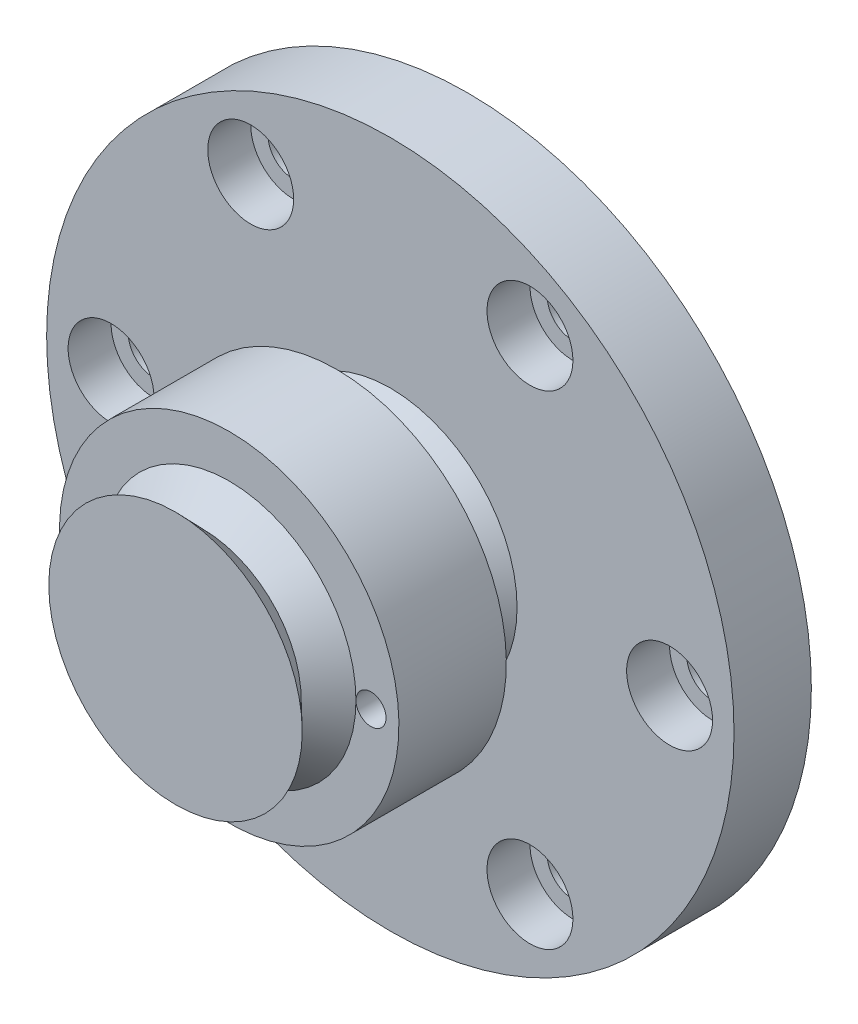
ISO-10303-21;
HEADER;
FILE_DESCRIPTION(('STEP AP214'),'2;1');
FILE_NAME('part.step','',(''),(''),'','','');
FILE_SCHEMA(('AUTOMOTIVE_DESIGN { 1 0 10303 214 1 1 1 1 }'));
ENDSEC;
DATA;
#1=APPLICATION_CONTEXT('core data for automotive mechanical design processes');
#2=APPLICATION_PROTOCOL_DEFINITION('international standard','automotive_design',2000,#1);
#3=PRODUCT_CONTEXT('',#1,'mechanical');
#4=PRODUCT('Part','Part','',(#3));
#5=PRODUCT_RELATED_PRODUCT_CATEGORY('part','',(#4));
#6=PRODUCT_DEFINITION_FORMATION('','',#4);
#7=PRODUCT_DEFINITION_CONTEXT('part definition',#1,'design');
#8=PRODUCT_DEFINITION('design','',#6,#7);
#9=PRODUCT_DEFINITION_SHAPE('','',#8);
#10=(LENGTH_UNIT() NAMED_UNIT(*) SI_UNIT(.MILLI.,.METRE.));
#11=(NAMED_UNIT(*) PLANE_ANGLE_UNIT() SI_UNIT($,.RADIAN.));
#12=(NAMED_UNIT(*) SI_UNIT($,.STERADIAN.) SOLID_ANGLE_UNIT());
#13=UNCERTAINTY_MEASURE_WITH_UNIT(LENGTH_MEASURE(1.E-05),#10,'distance_accuracy_value','');
#14=(GEOMETRIC_REPRESENTATION_CONTEXT(3) GLOBAL_UNCERTAINTY_ASSIGNED_CONTEXT((#13)) GLOBAL_UNIT_ASSIGNED_CONTEXT((#10,
#11,#12)) REPRESENTATION_CONTEXT('',''));
#15=CARTESIAN_POINT('',(0.,0.,0.));
#16=DIRECTION('',(0.,0.,1.));
#17=DIRECTION('',(1.,0.,0.));
#18=AXIS2_PLACEMENT_3D('',#15,#16,#17);
#19=CARTESIAN_POINT('',(0.,0.,13.6));
#20=DIRECTION('',(0.,0.,-1.));
#21=DIRECTION('',(-1.,0.,0.));
#22=AXIS2_PLACEMENT_3D('',#19,#20,#21);
#23=CYLINDRICAL_SURFACE('',#22,7.9);
#24=CARTESIAN_POINT('',(0.,0.,6.1));
#25=DIRECTION('',(0.,0.,-1.));
#26=DIRECTION('',(0.,1.,0.));
#27=AXIS2_PLACEMENT_3D('',#24,#25,#26);
#28=CIRCLE('',#27,7.9);
#29=CARTESIAN_POINT('',(0.,7.9,6.1));
#30=VERTEX_POINT('',#29);
#31=EDGE_CURVE('E68',#30,#30,#28,.T.);
#32=ORIENTED_EDGE('',*,*,#31,.F.);
#33=EDGE_LOOP('',(#32));
#34=FACE_BOUND('',#33,.T.);
#35=CARTESIAN_POINT('',(0.,0.,11.1));
#36=DIRECTION('',(0.,0.,-1.));
#37=DIRECTION('',(0.,1.,0.));
#38=AXIS2_PLACEMENT_3D('',#35,#36,#37);
#39=CIRCLE('',#38,7.9);
#40=CARTESIAN_POINT('',(0.,7.9,11.1));
#41=VERTEX_POINT('',#40);
#42=EDGE_CURVE('E71',#41,#41,#39,.T.);
#43=ORIENTED_EDGE('',*,*,#42,.T.);
#44=EDGE_LOOP('',(#43));
#45=FACE_BOUND('',#44,.T.);
#46=ADVANCED_FACE('F33',(#34,#45),#23,.T.);
#47=CARTESIAN_POINT('',(0.,0.,13.6));
#48=DIRECTION('',(0.,0.,1.));
#49=DIRECTION('',(0.,-1.,0.));
#50=AXIS2_PLACEMENT_3D('',#47,#48,#49);
#51=CONICAL_SURFACE('',#50,5.9,0.805003494254653);
#52=CARTESIAN_POINT('',(0.,0.,12.35));
#53=DIRECTION('',(0.,0.,-1.));
#54=DIRECTION('',(0.,1.,0.));
#55=AXIS2_PLACEMENT_3D('',#52,#53,#54);
#56=CIRCLE('',#55,4.6);
#57=CARTESIAN_POINT('',(0.,4.6,12.35));
#58=VERTEX_POINT('',#57);
#59=EDGE_CURVE('E77',#58,#58,#56,.T.);
#60=ORIENTED_EDGE('',*,*,#59,.F.);
#61=EDGE_LOOP('',(#60));
#62=FACE_BOUND('',#61,.T.);
#63=CARTESIAN_POINT('',(0.,0.,13.6));
#64=DIRECTION('',(0.,0.,-1.));
#65=DIRECTION('',(0.,1.,0.));
#66=AXIS2_PLACEMENT_3D('',#63,#64,#65);
#67=CIRCLE('',#66,5.9);
#68=CARTESIAN_POINT('',(0.,5.9,13.6));
#69=VERTEX_POINT('',#68);
#70=EDGE_CURVE('E80',#69,#69,#67,.T.);
#71=ORIENTED_EDGE('',*,*,#70,.T.);
#72=EDGE_LOOP('',(#71));
#73=FACE_BOUND('',#72,.T.);
#74=ADVANCED_FACE('F223',(#62,#73),#51,.T.);
#75=CARTESIAN_POINT('',(0.,0.,12.35));
#76=DIRECTION('',(0.,0.,-1.));
#77=DIRECTION('',(0.,1.,0.));
#78=AXIS2_PLACEMENT_3D('',#75,#76,#77);
#79=CONICAL_SURFACE('',#78,4.6,0.805003494254653);
#80=CARTESIAN_POINT('',(0.,0.,11.1));
#81=DIRECTION('',(0.,0.,-1.));
#82=DIRECTION('',(0.,1.,0.));
#83=AXIS2_PLACEMENT_3D('',#80,#81,#82);
#84=CIRCLE('',#83,5.9);
#85=CARTESIAN_POINT('',(5.9,0.,11.1));
#86=VERTEX_POINT('',#85);
#87=EDGE_CURVE('E74',#86,#86,#84,.T.);
#88=ORIENTED_EDGE('',*,*,#87,.F.);
#89=EDGE_LOOP('',(#88));
#90=FACE_BOUND('',#89,.T.);
#91=ORIENTED_EDGE('',*,*,#59,.T.);
#92=EDGE_LOOP('',(#91));
#93=FACE_BOUND('',#92,.T.);
#94=ADVANCED_FACE('F230',(#90,#93),#79,.T.);
#95=CARTESIAN_POINT('',(0.,5.9,11.1));
#96=DIRECTION('',(0.,0.,-1.));
#97=DIRECTION('',(0.,1.,0.));
#98=AXIS2_PLACEMENT_3D('',#95,#96,#97);
#99=PLANE('',#98);
#100=ORIENTED_EDGE('',*,*,#42,.F.);
#101=EDGE_LOOP('',(#100));
#102=FACE_BOUND('',#101,.T.);
#103=ORIENTED_EDGE('',*,*,#87,.T.);
#104=CARTESIAN_POINT('',(6.6,0.,11.1));
#105=DIRECTION('',(0.,0.,1.));
#106=DIRECTION('',(1.,0.,0.));
#107=AXIS2_PLACEMENT_3D('',#104,#105,#106);
#108=CIRCLE('',#107,0.7);
#109=EDGE_CURVE('E48',#86,#86,#108,.T.);
#110=ORIENTED_EDGE('',*,*,#109,.F.);
#111=EDGE_LOOP('',(#103,#110));
#112=FACE_BOUND('',#111,.T.);
#113=ADVANCED_FACE('F227',(#102,#112),#99,.F.);
#114=CARTESIAN_POINT('',(0.,0.,13.6));
#115=DIRECTION('',(0.,0.,1.));
#116=DIRECTION('',(1.,0.,0.));
#117=AXIS2_PLACEMENT_3D('',#114,#115,#116);
#118=PLANE('',#117);
#119=ORIENTED_EDGE('',*,*,#70,.F.);
#120=EDGE_LOOP('',(#119));
#121=FACE_BOUND('',#120,.T.);
#122=ADVANCED_FACE('F217',(#121),#118,.T.);
#123=CARTESIAN_POINT('',(0.,5.9,6.1));
#124=DIRECTION('',(0.,0.,1.));
#125=DIRECTION('',(0.,-1.,0.));
#126=AXIS2_PLACEMENT_3D('',#123,#124,#125);
#127=PLANE('',#126);
#128=CARTESIAN_POINT('',(0.,0.,6.1));
#129=DIRECTION('',(0.,0.,-1.));
#130=DIRECTION('',(0.,1.,0.));
#131=AXIS2_PLACEMENT_3D('',#128,#129,#130);
#132=CIRCLE('',#131,5.9);
#133=CARTESIAN_POINT('',(5.9,0.,6.1));
#134=VERTEX_POINT('',#133);
#135=EDGE_CURVE('E57',#134,#134,#132,.T.);
#136=ORIENTED_EDGE('',*,*,#135,.F.);
#137=CARTESIAN_POINT('',(6.6,0.,6.1));
#138=DIRECTION('',(0.,0.,1.));
#139=DIRECTION('',(0.,-1.,0.));
#140=AXIS2_PLACEMENT_3D('',#137,#138,#139);
#141=CIRCLE('',#140,0.7);
#142=EDGE_CURVE('E52',#134,#134,#141,.F.);
#143=ORIENTED_EDGE('',*,*,#142,.F.);
#144=EDGE_LOOP('',(#136,#143));
#145=FACE_BOUND('',#144,.T.);
#146=ORIENTED_EDGE('',*,*,#31,.T.);
#147=EDGE_LOOP('',(#146));
#148=FACE_BOUND('',#147,.T.);
#149=ADVANCED_FACE('F207',(#145,#148),#127,.F.);
#150=CARTESIAN_POINT('',(0.,0.,4.85));
#151=DIRECTION('',(0.,0.,-1.));
#152=DIRECTION('',(0.,1.,0.));
#153=AXIS2_PLACEMENT_3D('',#150,#151,#152);
#154=CONICAL_SURFACE('',#153,4.6,0.805003494254653);
#155=CARTESIAN_POINT('',(0.,0.,3.6));
#156=DIRECTION('',(0.,0.,-1.));
#157=DIRECTION('',(0.,1.,0.));
#158=AXIS2_PLACEMENT_3D('',#155,#156,#157);
#159=CIRCLE('',#158,5.9);
#160=CARTESIAN_POINT('',(0.,5.9,3.6));
#161=VERTEX_POINT('',#160);
#162=EDGE_CURVE('E65',#161,#161,#159,.T.);
#163=ORIENTED_EDGE('',*,*,#162,.F.);
#164=EDGE_LOOP('',(#163));
#165=FACE_BOUND('',#164,.T.);
#166=CARTESIAN_POINT('',(0.,0.,4.85));
#167=DIRECTION('',(0.,0.,-1.));
#168=DIRECTION('',(0.,1.,0.));
#169=AXIS2_PLACEMENT_3D('',#166,#167,#168);
#170=CIRCLE('',#169,4.6);
#171=CARTESIAN_POINT('',(0.,4.6,4.85));
#172=VERTEX_POINT('',#171);
#173=EDGE_CURVE('E59',#172,#172,#170,.T.);
#174=ORIENTED_EDGE('',*,*,#173,.T.);
#175=EDGE_LOOP('',(#174));
#176=FACE_BOUND('',#175,.T.);
#177=ADVANCED_FACE('F203',(#165,#176),#154,.T.);
#178=CARTESIAN_POINT('',(0.,0.,6.1));
#179=DIRECTION('',(0.,0.,1.));
#180=DIRECTION('',(0.,-1.,0.));
#181=AXIS2_PLACEMENT_3D('',#178,#179,#180);
#182=CONICAL_SURFACE('',#181,5.9,0.805003494254653);
#183=ORIENTED_EDGE('',*,*,#173,.F.);
#184=EDGE_LOOP('',(#183));
#185=FACE_BOUND('',#184,.T.);
#186=ORIENTED_EDGE('',*,*,#135,.T.);
#187=EDGE_LOOP('',(#186));
#188=FACE_BOUND('',#187,.T.);
#189=ADVANCED_FACE('F206',(#185,#188),#182,.T.);
#190=CARTESIAN_POINT('',(6.,0.,2.));
#191=DIRECTION('',(0.,0.,-1.));
#192=DIRECTION('',(-1.,0.,0.));
#193=AXIS2_PLACEMENT_3D('',#190,#191,#192);
#194=PLANE('',#193);
#195=CARTESIAN_POINT('',(6.,0.,2.));
#196=DIRECTION('',(0.,0.,-1.));
#197=DIRECTION('',(-1.,0.,0.));
#198=AXIS2_PLACEMENT_3D('',#195,#196,#197);
#199=CIRCLE('',#198,1.);
#200=CARTESIAN_POINT('',(5.,0.,2.));
#201=VERTEX_POINT('',#200);
#202=EDGE_CURVE('E90',#201,#201,#199,.T.);
#203=ORIENTED_EDGE('',*,*,#202,.T.);
#204=EDGE_LOOP('',(#203));
#205=FACE_BOUND('',#204,.T.);
#206=ADVANCED_FACE('F213',(#205),#194,.T.);
#207=CARTESIAN_POINT('',(-6.,0.,2.));
#208=DIRECTION('',(0.,0.,-1.));
#209=DIRECTION('',(-1.,0.,0.));
#210=AXIS2_PLACEMENT_3D('',#207,#208,#209);
#211=PLANE('',#210);
#212=CARTESIAN_POINT('',(-6.,0.,2.));
#213=DIRECTION('',(0.,0.,-1.));
#214=DIRECTION('',(-1.,0.,0.));
#215=AXIS2_PLACEMENT_3D('',#212,#213,#214);
#216=CIRCLE('',#215,1.);
#217=CARTESIAN_POINT('',(-7.,0.,2.));
#218=VERTEX_POINT('',#217);
#219=EDGE_CURVE('E84',#218,#218,#216,.T.);
#220=ORIENTED_EDGE('',*,*,#219,.T.);
#221=EDGE_LOOP('',(#220));
#222=FACE_BOUND('',#221,.T.);
#223=ADVANCED_FACE('F249',(#222),#211,.T.);
#224=CARTESIAN_POINT('',(6.,0.,2.));
#225=DIRECTION('',(0.,0.,-1.));
#226=DIRECTION('',(-1.,0.,0.));
#227=AXIS2_PLACEMENT_3D('',#224,#225,#226);
#228=CYLINDRICAL_SURFACE('',#227,1.);
#229=ORIENTED_EDGE('',*,*,#202,.F.);
#230=EDGE_LOOP('',(#229));
#231=FACE_BOUND('',#230,.T.);
#232=CARTESIAN_POINT('',(6.,0.,0.));
#233=DIRECTION('',(0.,0.,-1.));
#234=DIRECTION('',(-1.,0.,0.));
#235=AXIS2_PLACEMENT_3D('',#232,#233,#234);
#236=CIRCLE('',#235,1.);
#237=CARTESIAN_POINT('',(5.,0.,0.));
#238=VERTEX_POINT('',#237);
#239=EDGE_CURVE('E87',#238,#238,#236,.T.);
#240=ORIENTED_EDGE('',*,*,#239,.T.);
#241=EDGE_LOOP('',(#240));
#242=FACE_BOUND('',#241,.T.);
#243=ADVANCED_FACE('F252',(#231,#242),#228,.F.);
#244=CARTESIAN_POINT('',(-6.,0.,2.));
#245=DIRECTION('',(0.,0.,-1.));
#246=DIRECTION('',(-1.,0.,0.));
#247=AXIS2_PLACEMENT_3D('',#244,#245,#246);
#248=CYLINDRICAL_SURFACE('',#247,1.);
#249=ORIENTED_EDGE('',*,*,#219,.F.);
#250=EDGE_LOOP('',(#249));
#251=FACE_BOUND('',#250,.T.);
#252=CARTESIAN_POINT('',(-6.,0.,0.));
#253=DIRECTION('',(0.,0.,-1.));
#254=DIRECTION('',(-1.,0.,0.));
#255=AXIS2_PLACEMENT_3D('',#252,#253,#254);
#256=CIRCLE('',#255,1.);
#257=CARTESIAN_POINT('',(-7.,0.,0.));
#258=VERTEX_POINT('',#257);
#259=EDGE_CURVE('E83',#258,#258,#256,.T.);
#260=ORIENTED_EDGE('',*,*,#259,.T.);
#261=EDGE_LOOP('',(#260));
#262=FACE_BOUND('',#261,.T.);
#263=ADVANCED_FACE('F254',(#251,#262),#248,.F.);
#264=CARTESIAN_POINT('',(13.,0.,3.6));
#265=DIRECTION('',(0.,0.,-1.));
#266=DIRECTION('',(-1.,0.,0.));
#267=AXIS2_PLACEMENT_3D('',#264,#265,#266);
#268=CYLINDRICAL_SURFACE('',#267,1.2);
#269=CARTESIAN_POINT('',(13.,0.,0.));
#270=DIRECTION('',(0.,0.,1.));
#271=DIRECTION('',(1.,0.,0.));
#272=AXIS2_PLACEMENT_3D('',#269,#270,#271);
#273=CIRCLE('',#272,1.2);
#274=CARTESIAN_POINT('',(14.2,0.,0.));
#275=VERTEX_POINT('',#274);
#276=EDGE_CURVE('E148',#275,#275,#273,.T.);
#277=ORIENTED_EDGE('',*,*,#276,.F.);
#278=EDGE_LOOP('',(#277));
#279=FACE_BOUND('',#278,.T.);
#280=CARTESIAN_POINT('',(13.,0.,1.6));
#281=DIRECTION('',(0.,0.,1.));
#282=DIRECTION('',(1.,0.,0.));
#283=AXIS2_PLACEMENT_3D('',#280,#281,#282);
#284=CIRCLE('',#283,1.2);
#285=CARTESIAN_POINT('',(14.2,0.,1.6));
#286=VERTEX_POINT('',#285);
#287=EDGE_CURVE('E129',#286,#286,#284,.T.);
#288=ORIENTED_EDGE('',*,*,#287,.T.);
#289=EDGE_LOOP('',(#288));
#290=FACE_BOUND('',#289,.T.);
#291=ADVANCED_FACE('F257',(#279,#290),#268,.F.);
#292=CARTESIAN_POINT('',(6.50000000000013,11.2583302491976,3.6));
#293=DIRECTION('',(0.,0.,-1.));
#294=DIRECTION('',(-1.,0.,0.));
#295=AXIS2_PLACEMENT_3D('',#292,#293,#294);
#296=CYLINDRICAL_SURFACE('',#295,1.2);
#297=CARTESIAN_POINT('',(6.50000000000013,11.2583302491976,0.));
#298=DIRECTION('',(0.,0.,1.));
#299=DIRECTION('',(1.,0.,0.));
#300=AXIS2_PLACEMENT_3D('',#297,#298,#299);
#301=CIRCLE('',#300,1.2);
#302=CARTESIAN_POINT('',(7.70000000000013,11.2583302491976,0.));
#303=VERTEX_POINT('',#302);
#304=EDGE_CURVE('E133',#303,#303,#301,.T.);
#305=ORIENTED_EDGE('',*,*,#304,.F.);
#306=EDGE_LOOP('',(#305));
#307=FACE_BOUND('',#306,.T.);
#308=CARTESIAN_POINT('',(6.50000000000013,11.2583302491976,1.6));
#309=DIRECTION('',(0.,0.,1.));
#310=DIRECTION('',(1.,0.,0.));
#311=AXIS2_PLACEMENT_3D('',#308,#309,#310);
#312=CIRCLE('',#311,1.2);
#313=CARTESIAN_POINT('',(7.70000000000013,11.2583302491976,1.6));
#314=VERTEX_POINT('',#313);
#315=EDGE_CURVE('E99',#314,#314,#312,.T.);
#316=ORIENTED_EDGE('',*,*,#315,.T.);
#317=EDGE_LOOP('',(#316));
#318=FACE_BOUND('',#317,.T.);
#319=ADVANCED_FACE('F304',(#307,#318),#296,.F.);
#320=CARTESIAN_POINT('',(-6.4999999999999,11.2583302491978,3.6));
#321=DIRECTION('',(0.,0.,-1.));
#322=DIRECTION('',(-1.,0.,0.));
#323=AXIS2_PLACEMENT_3D('',#320,#321,#322);
#324=CYLINDRICAL_SURFACE('',#323,1.2);
#325=CARTESIAN_POINT('',(-6.4999999999999,11.2583302491978,0.));
#326=DIRECTION('',(0.,0.,1.));
#327=DIRECTION('',(1.,0.,0.));
#328=AXIS2_PLACEMENT_3D('',#325,#326,#327);
#329=CIRCLE('',#328,1.2);
#330=CARTESIAN_POINT('',(-5.29999999999989,11.2583302491978,0.));
#331=VERTEX_POINT('',#330);
#332=EDGE_CURVE('E136',#331,#331,#329,.T.);
#333=ORIENTED_EDGE('',*,*,#332,.F.);
#334=EDGE_LOOP('',(#333));
#335=FACE_BOUND('',#334,.T.);
#336=CARTESIAN_POINT('',(-6.4999999999999,11.2583302491978,1.6));
#337=DIRECTION('',(0.,0.,1.));
#338=DIRECTION('',(1.,0.,0.));
#339=AXIS2_PLACEMENT_3D('',#336,#337,#338);
#340=CIRCLE('',#339,1.2);
#341=CARTESIAN_POINT('',(-5.29999999999989,11.2583302491978,1.6));
#342=VERTEX_POINT('',#341);
#343=EDGE_CURVE('E157',#342,#342,#340,.T.);
#344=ORIENTED_EDGE('',*,*,#343,.T.);
#345=EDGE_LOOP('',(#344));
#346=FACE_BOUND('',#345,.T.);
#347=ADVANCED_FACE('F307',(#335,#346),#324,.F.);
#348=CARTESIAN_POINT('',(-13.,0.,3.6));
#349=DIRECTION('',(0.,0.,-1.));
#350=DIRECTION('',(-1.,0.,0.));
#351=AXIS2_PLACEMENT_3D('',#348,#349,#350);
#352=CYLINDRICAL_SURFACE('',#351,1.2);
#353=CARTESIAN_POINT('',(-13.,0.,0.));
#354=DIRECTION('',(0.,0.,1.));
#355=DIRECTION('',(1.,0.,0.));
#356=AXIS2_PLACEMENT_3D('',#353,#354,#355);
#357=CIRCLE('',#356,1.2);
#358=CARTESIAN_POINT('',(-11.8,0.,0.));
#359=VERTEX_POINT('',#358);
#360=EDGE_CURVE('E139',#359,#359,#357,.T.);
#361=ORIENTED_EDGE('',*,*,#360,.F.);
#362=EDGE_LOOP('',(#361));
#363=FACE_BOUND('',#362,.T.);
#364=CARTESIAN_POINT('',(-13.,0.,1.6));
#365=DIRECTION('',(0.,0.,1.));
#366=DIRECTION('',(1.,0.,0.));
#367=AXIS2_PLACEMENT_3D('',#364,#365,#366);
#368=CIRCLE('',#367,1.2);
#369=CARTESIAN_POINT('',(-11.8,0.,1.6));
#370=VERTEX_POINT('',#369);
#371=EDGE_CURVE('E160',#370,#370,#368,.T.);
#372=ORIENTED_EDGE('',*,*,#371,.T.);
#373=EDGE_LOOP('',(#372));
#374=FACE_BOUND('',#373,.T.);
#375=ADVANCED_FACE('F311',(#363,#374),#352,.F.);
#376=CARTESIAN_POINT('',(-6.50000000000005,-11.2583302491977,3.6));
#377=DIRECTION('',(0.,0.,-1.));
#378=DIRECTION('',(-1.,0.,0.));
#379=AXIS2_PLACEMENT_3D('',#376,#377,#378);
#380=CYLINDRICAL_SURFACE('',#379,1.2);
#381=CARTESIAN_POINT('',(-6.50000000000005,-11.2583302491977,0.));
#382=DIRECTION('',(0.,0.,1.));
#383=DIRECTION('',(1.,0.,0.));
#384=AXIS2_PLACEMENT_3D('',#381,#382,#383);
#385=CIRCLE('',#384,1.2);
#386=CARTESIAN_POINT('',(-5.30000000000005,-11.2583302491977,0.));
#387=VERTEX_POINT('',#386);
#388=EDGE_CURVE('E142',#387,#387,#385,.T.);
#389=ORIENTED_EDGE('',*,*,#388,.F.);
#390=EDGE_LOOP('',(#389));
#391=FACE_BOUND('',#390,.T.);
#392=CARTESIAN_POINT('',(-6.50000000000005,-11.2583302491977,1.6));
#393=DIRECTION('',(0.,0.,1.));
#394=DIRECTION('',(1.,0.,0.));
#395=AXIS2_PLACEMENT_3D('',#392,#393,#394);
#396=CIRCLE('',#395,1.2);
#397=CARTESIAN_POINT('',(-5.30000000000005,-11.2583302491977,1.6));
#398=VERTEX_POINT('',#397);
#399=EDGE_CURVE('E162',#398,#398,#396,.T.);
#400=ORIENTED_EDGE('',*,*,#399,.T.);
#401=EDGE_LOOP('',(#400));
#402=FACE_BOUND('',#401,.T.);
#403=ADVANCED_FACE('F315',(#391,#402),#380,.F.);
#404=CARTESIAN_POINT('',(6.49999999999997,-11.2583302491977,3.6));
#405=DIRECTION('',(0.,0.,-1.));
#406=DIRECTION('',(-1.,0.,0.));
#407=AXIS2_PLACEMENT_3D('',#404,#405,#406);
#408=CYLINDRICAL_SURFACE('',#407,1.2);
#409=CARTESIAN_POINT('',(6.49999999999997,-11.2583302491977,0.));
#410=DIRECTION('',(0.,0.,1.));
#411=DIRECTION('',(1.,0.,0.));
#412=AXIS2_PLACEMENT_3D('',#409,#410,#411);
#413=CIRCLE('',#412,1.2);
#414=CARTESIAN_POINT('',(7.69999999999997,-11.2583302491977,0.));
#415=VERTEX_POINT('',#414);
#416=EDGE_CURVE('E145',#415,#415,#413,.T.);
#417=ORIENTED_EDGE('',*,*,#416,.F.);
#418=EDGE_LOOP('',(#417));
#419=FACE_BOUND('',#418,.T.);
#420=CARTESIAN_POINT('',(6.49999999999997,-11.2583302491977,1.6));
#421=DIRECTION('',(0.,0.,1.));
#422=DIRECTION('',(1.,0.,0.));
#423=AXIS2_PLACEMENT_3D('',#420,#421,#422);
#424=CIRCLE('',#423,1.2);
#425=CARTESIAN_POINT('',(7.69999999999997,-11.2583302491977,1.6));
#426=VERTEX_POINT('',#425);
#427=EDGE_CURVE('E37',#426,#426,#424,.T.);
#428=ORIENTED_EDGE('',*,*,#427,.T.);
#429=EDGE_LOOP('',(#428));
#430=FACE_BOUND('',#429,.T.);
#431=ADVANCED_FACE('F169',(#419,#430),#408,.F.);
#432=CARTESIAN_POINT('',(0.,0.,0.));
#433=DIRECTION('',(0.,0.,1.));
#434=DIRECTION('',(1.,0.,0.));
#435=AXIS2_PLACEMENT_3D('',#432,#433,#434);
#436=PLANE('',#435);
#437=ORIENTED_EDGE('',*,*,#259,.F.);
#438=EDGE_LOOP('',(#437));
#439=FACE_BOUND('',#438,.T.);
#440=ORIENTED_EDGE('',*,*,#239,.F.);
#441=EDGE_LOOP('',(#440));
#442=FACE_BOUND('',#441,.T.);
#443=CARTESIAN_POINT('',(0.,0.,0.));
#444=DIRECTION('',(0.,0.,1.));
#445=DIRECTION('',(1.,0.,0.));
#446=AXIS2_PLACEMENT_3D('',#443,#444,#445);
#447=CIRCLE('',#446,16.);
#448=CARTESIAN_POINT('',(16.,0.,0.));
#449=VERTEX_POINT('',#448);
#450=EDGE_CURVE('E42',#449,#449,#447,.T.);
#451=ORIENTED_EDGE('',*,*,#450,.F.);
#452=EDGE_LOOP('',(#451));
#453=FACE_BOUND('',#452,.T.);
#454=ORIENTED_EDGE('',*,*,#276,.T.);
#455=EDGE_LOOP('',(#454));
#456=FACE_BOUND('',#455,.T.);
#457=ORIENTED_EDGE('',*,*,#416,.T.);
#458=EDGE_LOOP('',(#457));
#459=FACE_BOUND('',#458,.T.);
#460=ORIENTED_EDGE('',*,*,#388,.T.);
#461=EDGE_LOOP('',(#460));
#462=FACE_BOUND('',#461,.T.);
#463=ORIENTED_EDGE('',*,*,#360,.T.);
#464=EDGE_LOOP('',(#463));
#465=FACE_BOUND('',#464,.T.);
#466=ORIENTED_EDGE('',*,*,#332,.T.);
#467=EDGE_LOOP('',(#466));
#468=FACE_BOUND('',#467,.T.);
#469=ORIENTED_EDGE('',*,*,#304,.T.);
#470=EDGE_LOOP('',(#469));
#471=FACE_BOUND('',#470,.T.);
#472=ADVANCED_FACE('F299',(#439,#442,#453,#456,#459,#462,#465,#468,#471),#436,.F.);
#473=CARTESIAN_POINT('',(13.,0.,1.6));
#474=DIRECTION('',(0.,0.,1.));
#475=DIRECTION('',(1.,0.,0.));
#476=AXIS2_PLACEMENT_3D('',#473,#474,#475);
#477=PLANE('',#476);
#478=ORIENTED_EDGE('',*,*,#287,.F.);
#479=EDGE_LOOP('',(#478));
#480=FACE_BOUND('',#479,.T.);
#481=CARTESIAN_POINT('',(13.,0.,1.6));
#482=DIRECTION('',(0.,0.,1.));
#483=DIRECTION('',(1.,0.,0.));
#484=AXIS2_PLACEMENT_3D('',#481,#482,#483);
#485=CIRCLE('',#484,2.);
#486=CARTESIAN_POINT('',(15.,0.,1.6));
#487=VERTEX_POINT('',#486);
#488=EDGE_CURVE('E126',#487,#487,#485,.T.);
#489=ORIENTED_EDGE('',*,*,#488,.T.);
#490=EDGE_LOOP('',(#489));
#491=FACE_BOUND('',#490,.T.);
#492=ADVANCED_FACE('F291',(#480,#491),#477,.T.);
#493=CARTESIAN_POINT('',(6.50000000000013,11.2583302491976,1.6));
#494=DIRECTION('',(0.,0.,1.));
#495=DIRECTION('',(1.,0.,0.));
#496=AXIS2_PLACEMENT_3D('',#493,#494,#495);
#497=PLANE('',#496);
#498=ORIENTED_EDGE('',*,*,#315,.F.);
#499=EDGE_LOOP('',(#498));
#500=FACE_BOUND('',#499,.T.);
#501=CARTESIAN_POINT('',(6.50000000000013,11.2583302491976,1.6));
#502=DIRECTION('',(0.,0.,1.));
#503=DIRECTION('',(1.,0.,0.));
#504=AXIS2_PLACEMENT_3D('',#501,#502,#503);
#505=CIRCLE('',#504,2.);
#506=CARTESIAN_POINT('',(8.50000000000013,11.2583302491976,1.6));
#507=VERTEX_POINT('',#506);
#508=EDGE_CURVE('E121',#507,#507,#505,.T.);
#509=ORIENTED_EDGE('',*,*,#508,.T.);
#510=EDGE_LOOP('',(#509));
#511=FACE_BOUND('',#510,.T.);
#512=ADVANCED_FACE('F283',(#500,#511),#497,.T.);
#513=CARTESIAN_POINT('',(-6.4999999999999,11.2583302491978,1.6));
#514=DIRECTION('',(0.,0.,1.));
#515=DIRECTION('',(1.,0.,0.));
#516=AXIS2_PLACEMENT_3D('',#513,#514,#515);
#517=PLANE('',#516);
#518=ORIENTED_EDGE('',*,*,#343,.F.);
#519=EDGE_LOOP('',(#518));
#520=FACE_BOUND('',#519,.T.);
#521=CARTESIAN_POINT('',(-6.4999999999999,11.2583302491978,1.6));
#522=DIRECTION('',(0.,0.,1.));
#523=DIRECTION('',(1.,0.,0.));
#524=AXIS2_PLACEMENT_3D('',#521,#522,#523);
#525=CIRCLE('',#524,2.);
#526=CARTESIAN_POINT('',(-4.4999999999999,11.2583302491978,1.6));
#527=VERTEX_POINT('',#526);
#528=EDGE_CURVE('E115',#527,#527,#525,.T.);
#529=ORIENTED_EDGE('',*,*,#528,.T.);
#530=EDGE_LOOP('',(#529));
#531=FACE_BOUND('',#530,.T.);
#532=ADVANCED_FACE('F275',(#520,#531),#517,.T.);
#533=CARTESIAN_POINT('',(-13.,0.,1.6));
#534=DIRECTION('',(0.,0.,1.));
#535=DIRECTION('',(1.,0.,0.));
#536=AXIS2_PLACEMENT_3D('',#533,#534,#535);
#537=PLANE('',#536);
#538=ORIENTED_EDGE('',*,*,#371,.F.);
#539=EDGE_LOOP('',(#538));
#540=FACE_BOUND('',#539,.T.);
#541=CARTESIAN_POINT('',(-13.,0.,1.6));
#542=DIRECTION('',(0.,0.,1.));
#543=DIRECTION('',(1.,0.,0.));
#544=AXIS2_PLACEMENT_3D('',#541,#542,#543);
#545=CIRCLE('',#544,2.);
#546=CARTESIAN_POINT('',(-11.,0.,1.6));
#547=VERTEX_POINT('',#546);
#548=EDGE_CURVE('E109',#547,#547,#545,.T.);
#549=ORIENTED_EDGE('',*,*,#548,.T.);
#550=EDGE_LOOP('',(#549));
#551=FACE_BOUND('',#550,.T.);
#552=ADVANCED_FACE('F267',(#540,#551),#537,.T.);
#553=CARTESIAN_POINT('',(-6.50000000000005,-11.2583302491977,1.6));
#554=DIRECTION('',(0.,0.,1.));
#555=DIRECTION('',(1.,0.,0.));
#556=AXIS2_PLACEMENT_3D('',#553,#554,#555);
#557=PLANE('',#556);
#558=ORIENTED_EDGE('',*,*,#399,.F.);
#559=EDGE_LOOP('',(#558));
#560=FACE_BOUND('',#559,.T.);
#561=CARTESIAN_POINT('',(-6.50000000000005,-11.2583302491977,1.6));
#562=DIRECTION('',(0.,0.,1.));
#563=DIRECTION('',(1.,0.,0.));
#564=AXIS2_PLACEMENT_3D('',#561,#562,#563);
#565=CIRCLE('',#564,2.);
#566=CARTESIAN_POINT('',(-4.50000000000005,-11.2583302491977,1.6));
#567=VERTEX_POINT('',#566);
#568=EDGE_CURVE('E103',#567,#567,#565,.T.);
#569=ORIENTED_EDGE('',*,*,#568,.T.);
#570=EDGE_LOOP('',(#569));
#571=FACE_BOUND('',#570,.T.);
#572=ADVANCED_FACE('F174',(#560,#571),#557,.T.);
#573=CARTESIAN_POINT('',(6.49999999999997,-11.2583302491977,1.6));
#574=DIRECTION('',(0.,0.,1.));
#575=DIRECTION('',(1.,0.,0.));
#576=AXIS2_PLACEMENT_3D('',#573,#574,#575);
#577=PLANE('',#576);
#578=ORIENTED_EDGE('',*,*,#427,.F.);
#579=EDGE_LOOP('',(#578));
#580=FACE_BOUND('',#579,.T.);
#581=CARTESIAN_POINT('',(6.49999999999997,-11.2583302491977,1.6));
#582=DIRECTION('',(0.,0.,1.));
#583=DIRECTION('',(1.,0.,0.));
#584=AXIS2_PLACEMENT_3D('',#581,#582,#583);
#585=CIRCLE('',#584,2.);
#586=CARTESIAN_POINT('',(8.49999999999997,-11.2583302491977,1.6));
#587=VERTEX_POINT('',#586);
#588=EDGE_CURVE('E96',#587,#587,#585,.T.);
#589=ORIENTED_EDGE('',*,*,#588,.T.);
#590=EDGE_LOOP('',(#589));
#591=FACE_BOUND('',#590,.T.);
#592=ADVANCED_FACE('F171',(#580,#591),#577,.T.);
#593=CARTESIAN_POINT('',(0.,0.,3.6));
#594=DIRECTION('',(0.,0.,-1.));
#595=DIRECTION('',(-1.,0.,0.));
#596=AXIS2_PLACEMENT_3D('',#593,#594,#595);
#597=CYLINDRICAL_SURFACE('',#596,16.);
#598=CARTESIAN_POINT('',(0.,0.,3.6));
#599=DIRECTION('',(0.,0.,1.));
#600=DIRECTION('',(1.,0.,0.));
#601=AXIS2_PLACEMENT_3D('',#598,#599,#600);
#602=CIRCLE('',#601,16.);
#603=CARTESIAN_POINT('',(16.,0.,3.6));
#604=VERTEX_POINT('',#603);
#605=EDGE_CURVE('E11',#604,#604,#602,.T.);
#606=ORIENTED_EDGE('',*,*,#605,.F.);
#607=EDGE_LOOP('',(#606));
#608=FACE_BOUND('',#607,.T.);
#609=ORIENTED_EDGE('',*,*,#450,.T.);
#610=EDGE_LOOP('',(#609));
#611=FACE_BOUND('',#610,.T.);
#612=ADVANCED_FACE('F35',(#608,#611),#597,.T.);
#613=CARTESIAN_POINT('',(13.,0.,1.6));
#614=DIRECTION('',(0.,0.,1.));
#615=DIRECTION('',(1.,0.,0.));
#616=AXIS2_PLACEMENT_3D('',#613,#614,#615);
#617=CYLINDRICAL_SURFACE('',#616,2.);
#618=ORIENTED_EDGE('',*,*,#488,.F.);
#619=EDGE_LOOP('',(#618));
#620=FACE_BOUND('',#619,.T.);
#621=CARTESIAN_POINT('',(13.,0.,3.6));
#622=DIRECTION('',(0.,0.,1.));
#623=DIRECTION('',(1.,0.,0.));
#624=AXIS2_PLACEMENT_3D('',#621,#622,#623);
#625=CIRCLE('',#624,2.);
#626=CARTESIAN_POINT('',(15.,0.,3.6));
#627=VERTEX_POINT('',#626);
#628=EDGE_CURVE('E130',#627,#627,#625,.T.);
#629=ORIENTED_EDGE('',*,*,#628,.T.);
#630=EDGE_LOOP('',(#629));
#631=FACE_BOUND('',#630,.T.);
#632=ADVANCED_FACE('F295',(#620,#631),#617,.F.);
#633=CARTESIAN_POINT('',(6.50000000000013,11.2583302491976,1.6));
#634=DIRECTION('',(0.,0.,1.));
#635=DIRECTION('',(1.,0.,0.));
#636=AXIS2_PLACEMENT_3D('',#633,#634,#635);
#637=CYLINDRICAL_SURFACE('',#636,2.);
#638=ORIENTED_EDGE('',*,*,#508,.F.);
#639=EDGE_LOOP('',(#638));
#640=FACE_BOUND('',#639,.T.);
#641=CARTESIAN_POINT('',(6.50000000000013,11.2583302491976,3.6));
#642=DIRECTION('',(0.,0.,1.));
#643=DIRECTION('',(1.,0.,0.));
#644=AXIS2_PLACEMENT_3D('',#641,#642,#643);
#645=CIRCLE('',#644,2.);
#646=CARTESIAN_POINT('',(8.50000000000013,11.2583302491976,3.6));
#647=VERTEX_POINT('',#646);
#648=EDGE_CURVE('E93',#647,#647,#645,.T.);
#649=ORIENTED_EDGE('',*,*,#648,.T.);
#650=EDGE_LOOP('',(#649));
#651=FACE_BOUND('',#650,.T.);
#652=ADVANCED_FACE('F287',(#640,#651),#637,.F.);
#653=CARTESIAN_POINT('',(-6.4999999999999,11.2583302491978,1.6));
#654=DIRECTION('',(0.,0.,1.));
#655=DIRECTION('',(1.,0.,0.));
#656=AXIS2_PLACEMENT_3D('',#653,#654,#655);
#657=CYLINDRICAL_SURFACE('',#656,2.);
#658=ORIENTED_EDGE('',*,*,#528,.F.);
#659=EDGE_LOOP('',(#658));
#660=FACE_BOUND('',#659,.T.);
#661=CARTESIAN_POINT('',(-6.4999999999999,11.2583302491978,3.6));
#662=DIRECTION('',(0.,0.,1.));
#663=DIRECTION('',(1.,0.,0.));
#664=AXIS2_PLACEMENT_3D('',#661,#662,#663);
#665=CIRCLE('',#664,2.);
#666=CARTESIAN_POINT('',(-4.4999999999999,11.2583302491978,3.6));
#667=VERTEX_POINT('',#666);
#668=EDGE_CURVE('E118',#667,#667,#665,.T.);
#669=ORIENTED_EDGE('',*,*,#668,.T.);
#670=EDGE_LOOP('',(#669));
#671=FACE_BOUND('',#670,.T.);
#672=ADVANCED_FACE('F279',(#660,#671),#657,.F.);
#673=CARTESIAN_POINT('',(-13.,0.,1.6));
#674=DIRECTION('',(0.,0.,1.));
#675=DIRECTION('',(1.,0.,0.));
#676=AXIS2_PLACEMENT_3D('',#673,#674,#675);
#677=CYLINDRICAL_SURFACE('',#676,2.);
#678=ORIENTED_EDGE('',*,*,#548,.F.);
#679=EDGE_LOOP('',(#678));
#680=FACE_BOUND('',#679,.T.);
#681=CARTESIAN_POINT('',(-13.,0.,3.6));
#682=DIRECTION('',(0.,0.,1.));
#683=DIRECTION('',(1.,0.,0.));
#684=AXIS2_PLACEMENT_3D('',#681,#682,#683);
#685=CIRCLE('',#684,2.);
#686=CARTESIAN_POINT('',(-11.,0.,3.6));
#687=VERTEX_POINT('',#686);
#688=EDGE_CURVE('E112',#687,#687,#685,.T.);
#689=ORIENTED_EDGE('',*,*,#688,.T.);
#690=EDGE_LOOP('',(#689));
#691=FACE_BOUND('',#690,.T.);
#692=ADVANCED_FACE('F271',(#680,#691),#677,.F.);
#693=CARTESIAN_POINT('',(-6.50000000000005,-11.2583302491977,1.6));
#694=DIRECTION('',(0.,0.,1.));
#695=DIRECTION('',(1.,0.,0.));
#696=AXIS2_PLACEMENT_3D('',#693,#694,#695);
#697=CYLINDRICAL_SURFACE('',#696,2.);
#698=ORIENTED_EDGE('',*,*,#568,.F.);
#699=EDGE_LOOP('',(#698));
#700=FACE_BOUND('',#699,.T.);
#701=CARTESIAN_POINT('',(-6.50000000000005,-11.2583302491977,3.6));
#702=DIRECTION('',(0.,0.,1.));
#703=DIRECTION('',(1.,0.,0.));
#704=AXIS2_PLACEMENT_3D('',#701,#702,#703);
#705=CIRCLE('',#704,2.);
#706=CARTESIAN_POINT('',(-4.50000000000005,-11.2583302491977,3.6));
#707=VERTEX_POINT('',#706);
#708=EDGE_CURVE('E106',#707,#707,#705,.T.);
#709=ORIENTED_EDGE('',*,*,#708,.T.);
#710=EDGE_LOOP('',(#709));
#711=FACE_BOUND('',#710,.T.);
#712=ADVANCED_FACE('F182',(#700,#711),#697,.F.);
#713=CARTESIAN_POINT('',(6.49999999999997,-11.2583302491977,1.6));
#714=DIRECTION('',(0.,0.,1.));
#715=DIRECTION('',(1.,0.,0.));
#716=AXIS2_PLACEMENT_3D('',#713,#714,#715);
#717=CYLINDRICAL_SURFACE('',#716,2.);
#718=ORIENTED_EDGE('',*,*,#588,.F.);
#719=EDGE_LOOP('',(#718));
#720=FACE_BOUND('',#719,.T.);
#721=CARTESIAN_POINT('',(6.49999999999997,-11.2583302491977,3.6));
#722=DIRECTION('',(0.,0.,1.));
#723=DIRECTION('',(1.,0.,0.));
#724=AXIS2_PLACEMENT_3D('',#721,#722,#723);
#725=CIRCLE('',#724,2.);
#726=CARTESIAN_POINT('',(8.49999999999997,-11.2583302491977,3.6));
#727=VERTEX_POINT('',#726);
#728=EDGE_CURVE('E100',#727,#727,#725,.T.);
#729=ORIENTED_EDGE('',*,*,#728,.T.);
#730=EDGE_LOOP('',(#729));
#731=FACE_BOUND('',#730,.T.);
#732=ADVANCED_FACE('F178',(#720,#731),#717,.F.);
#733=CARTESIAN_POINT('',(0.,0.,3.6));
#734=DIRECTION('',(0.,0.,1.));
#735=DIRECTION('',(1.,0.,0.));
#736=AXIS2_PLACEMENT_3D('',#733,#734,#735);
#737=PLANE('',#736);
#738=ORIENTED_EDGE('',*,*,#728,.F.);
#739=EDGE_LOOP('',(#738));
#740=FACE_BOUND('',#739,.T.);
#741=ORIENTED_EDGE('',*,*,#708,.F.);
#742=EDGE_LOOP('',(#741));
#743=FACE_BOUND('',#742,.T.);
#744=ORIENTED_EDGE('',*,*,#688,.F.);
#745=EDGE_LOOP('',(#744));
#746=FACE_BOUND('',#745,.T.);
#747=ORIENTED_EDGE('',*,*,#668,.F.);
#748=EDGE_LOOP('',(#747));
#749=FACE_BOUND('',#748,.T.);
#750=ORIENTED_EDGE('',*,*,#648,.F.);
#751=EDGE_LOOP('',(#750));
#752=FACE_BOUND('',#751,.T.);
#753=ORIENTED_EDGE('',*,*,#628,.F.);
#754=EDGE_LOOP('',(#753));
#755=FACE_BOUND('',#754,.T.);
#756=ORIENTED_EDGE('',*,*,#605,.T.);
#757=EDGE_LOOP('',(#756));
#758=FACE_BOUND('',#757,.T.);
#759=ORIENTED_EDGE('',*,*,#162,.T.);
#760=EDGE_LOOP('',(#759));
#761=FACE_BOUND('',#760,.T.);
#762=ADVANCED_FACE('F181',(#740,#743,#746,#749,#752,#755,#758,#761),#737,.T.);
#763=CARTESIAN_POINT('',(6.6,0.,4.12010101267767));
#764=DIRECTION('',(0.,0.,1.));
#765=DIRECTION('',(1.,0.,0.));
#766=AXIS2_PLACEMENT_3D('',#763,#764,#765);
#767=CYLINDRICAL_SURFACE('',#766,0.7);
#768=ORIENTED_EDGE('',*,*,#142,.T.);
#769=EDGE_LOOP('',(#768));
#770=FACE_BOUND('',#769,.T.);
#771=ORIENTED_EDGE('',*,*,#109,.T.);
#772=EDGE_LOOP('',(#771));
#773=FACE_BOUND('',#772,.T.);
#774=ADVANCED_FACE('F53',(#770,#773),#767,.F.);
#775=CLOSED_SHELL('',(#46,#74,#94,#113,#122,#149,#177,#189,#206,#223,#243,#263,#291,#319,#347,
#375,#403,#431,#472,#492,#512,#532,#552,#572,#592,#612,#632,#652,#672,#692,#712,#732,#762,#774));
#776=MANIFOLD_SOLID_BREP('B2',#775);
#777=ADVANCED_BREP_SHAPE_REPRESENTATION('',(#18,#776),#14);
#778=SHAPE_DEFINITION_REPRESENTATION(#9,#777);
ENDSEC;
END-ISO-10303-21;
